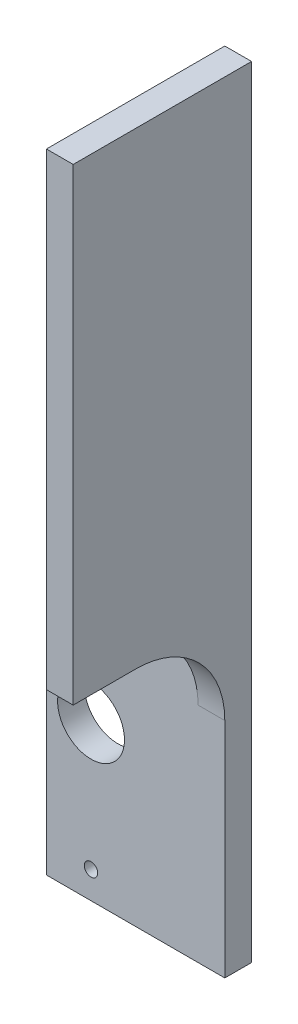
ISO-10303-21;
HEADER;
FILE_DESCRIPTION(('STEP AP214'),'2;1');
FILE_NAME('part.step','',(''),(''),'','','');
FILE_SCHEMA(('AUTOMOTIVE_DESIGN { 1 0 10303 214 1 1 1 1 }'));
ENDSEC;
DATA;
#1=APPLICATION_CONTEXT('core data for automotive mechanical design processes');
#2=APPLICATION_PROTOCOL_DEFINITION('international standard','automotive_design',2000,#1);
#3=PRODUCT_CONTEXT('',#1,'mechanical');
#4=PRODUCT('Part','Part','',(#3));
#5=PRODUCT_RELATED_PRODUCT_CATEGORY('part','',(#4));
#6=PRODUCT_DEFINITION_FORMATION('','',#4);
#7=PRODUCT_DEFINITION_CONTEXT('part definition',#1,'design');
#8=PRODUCT_DEFINITION('design','',#6,#7);
#9=PRODUCT_DEFINITION_SHAPE('','',#8);
#10=(LENGTH_UNIT() NAMED_UNIT(*) SI_UNIT(.MILLI.,.METRE.));
#11=(NAMED_UNIT(*) PLANE_ANGLE_UNIT() SI_UNIT($,.RADIAN.));
#12=(NAMED_UNIT(*) SI_UNIT($,.STERADIAN.) SOLID_ANGLE_UNIT());
#13=UNCERTAINTY_MEASURE_WITH_UNIT(LENGTH_MEASURE(1.E-05),#10,'distance_accuracy_value','');
#14=(GEOMETRIC_REPRESENTATION_CONTEXT(3) GLOBAL_UNCERTAINTY_ASSIGNED_CONTEXT((#13)) GLOBAL_UNIT_ASSIGNED_CONTEXT((#10,
#11,#12)) REPRESENTATION_CONTEXT('',''));
#15=CARTESIAN_POINT('',(0.,0.,0.));
#16=DIRECTION('',(0.,0.,1.));
#17=DIRECTION('',(1.,0.,0.));
#18=AXIS2_PLACEMENT_3D('',#15,#16,#17);
#19=CARTESIAN_POINT('',(10.6,25.,3.));
#20=CARTESIAN_POINT('',(10.4000000000003,25.,3.));
#21=CARTESIAN_POINT('',(10.1999999999997,25.,3.));
#22=CARTESIAN_POINT('',(9.0000000000016,25.,3.));
#23=CARTESIAN_POINT('',(8.00000000000025,24.9999999999983,3.));
#24=CARTESIAN_POINT('',(5.99999999999976,25.0000000000017,3.));
#25=CARTESIAN_POINT('',(5.0000000000002,24.9999999999983,3.));
#26=CARTESIAN_POINT('',(4.00000000000001,25.,3.));
#27=CARTESIAN_POINT('',(10.6,35.,3.));
#28=CARTESIAN_POINT('',(10.4000000000003,35.,3.));
#29=CARTESIAN_POINT('',(10.1999999999997,35.,3.));
#30=CARTESIAN_POINT('',(9.0000000000016,35.,3.));
#31=CARTESIAN_POINT('',(8.00000000000025,35.,3.));
#32=CARTESIAN_POINT('',(5.99999999999976,35.,3.));
#33=CARTESIAN_POINT('',(5.0000000000002,35.,3.));
#34=CARTESIAN_POINT('',(4.00000000000001,35.,3.));
#35=CARTESIAN_POINT('',(10.6,35.,13.));
#36=CARTESIAN_POINT('',(10.4000000000003,35.,13.));
#37=CARTESIAN_POINT('',(10.1999999999997,35.,13.));
#38=CARTESIAN_POINT('',(9.0000000000016,35.,13.));
#39=CARTESIAN_POINT('',(8.00000000000025,35.,13.0000000000017));
#40=CARTESIAN_POINT('',(5.99999999999976,35.,12.9999999999983));
#41=CARTESIAN_POINT('',(5.00000000000019,35.,13.0000000000017));
#42=CARTESIAN_POINT('',(4.00000000000001,35.,13.));
#43=(BOUNDED_SURFACE() B_SPLINE_SURFACE(2,3,((#19,#20,#21,#22,#23,#24,#25,#26),(#27,#28,#29,#30,
#31,#32,#33,#34),(#35,#36,#37,#38,#39,#40,#41,#42)),.UNSPECIFIED.,.F.,.F.,
.F.) B_SPLINE_SURFACE_WITH_KNOTS((3,3),(4,2,2,4),(0.,1.),(-0.200000000000003,0.,1.,2.),
.UNSPECIFIED.) GEOMETRIC_REPRESENTATION_ITEM() RATIONAL_B_SPLINE_SURFACE(((1.,1.,1.,1.,1.,1.,1.,
1.),(0.707106781186548,0.707106781186548,0.707106781186548,0.707106781186548,0.707106781186548,
0.707106781186548,0.707106781186548,0.707106781186548),(1.,1.,1.,1.,1.,1.,1.,1.))) REPRESENTATION_ITEM('') SURFACE());
#44=CARTESIAN_POINT('',(10.6,35.,13.));
#45=CARTESIAN_POINT('',(10.4000000000003,35.,13.));
#46=CARTESIAN_POINT('',(10.1999999999997,35.,13.));
#47=CARTESIAN_POINT('',(9.0000000000016,35.,13.));
#48=CARTESIAN_POINT('',(8.00000000000025,35.,13.0000000000017));
#49=CARTESIAN_POINT('',(5.99999999999976,35.,12.9999999999983));
#50=CARTESIAN_POINT('',(5.00000000000019,35.,13.0000000000017));
#51=CARTESIAN_POINT('',(4.00000000000001,35.,13.));
#52=(BOUNDED_CURVE() B_SPLINE_CURVE(3,(#44,#45,#46,#47,#48,#49,#50,#51),.UNSPECIFIED.,.F.,
.F.) B_SPLINE_CURVE_WITH_KNOTS((4,2,2,4),(-0.200000000000003,0.,1.,2.),
.UNSPECIFIED.) CURVE() GEOMETRIC_REPRESENTATION_ITEM() RATIONAL_B_SPLINE_CURVE((1.,1.,1.,1.,1.,
1.,1.,1.)) REPRESENTATION_ITEM(''));
#53=CARTESIAN_POINT('',(7.,35.,13.));
#54=VERTEX_POINT('',#53);
#55=CARTESIAN_POINT('',(10.,35.,13.));
#56=VERTEX_POINT('',#55);
#57=EDGE_CURVE('E248',#54,#56,#52,.F.);
#58=CARTESIAN_POINT('',(7.,35.,13.));
#59=CARTESIAN_POINT('',(7.,35.,3.));
#60=CARTESIAN_POINT('',(7.,25.,3.));
#61=(BOUNDED_CURVE() B_SPLINE_CURVE(2,(#58,#59,#60),.UNSPECIFIED.,.F.,
.F.) B_SPLINE_CURVE_WITH_KNOTS((3,3),(0.,1.),
.UNSPECIFIED.) CURVE() GEOMETRIC_REPRESENTATION_ITEM() RATIONAL_B_SPLINE_CURVE((1.,
0.707106781186548,1.)) REPRESENTATION_ITEM(''));
#62=CARTESIAN_POINT('',(7.,25.,3.));
#63=VERTEX_POINT('',#62);
#64=EDGE_CURVE('E61',#54,#63,#61,.T.);
#65=CARTESIAN_POINT('',(4.00000000000001,25.,3.));
#66=CARTESIAN_POINT('',(5.0000000000002,24.9999999999983,3.));
#67=CARTESIAN_POINT('',(5.99999999999976,25.0000000000017,3.));
#68=CARTESIAN_POINT('',(8.00000000000025,24.9999999999983,3.));
#69=CARTESIAN_POINT('',(9.0000000000016,25.,3.));
#70=CARTESIAN_POINT('',(10.1999999999997,25.,3.));
#71=CARTESIAN_POINT('',(10.4000000000003,25.,3.));
#72=CARTESIAN_POINT('',(10.6,25.,3.));
#73=(BOUNDED_CURVE() B_SPLINE_CURVE(3,(#65,#66,#67,#68,#69,#70,#71,#72),.UNSPECIFIED.,.F.,
.F.) B_SPLINE_CURVE_WITH_KNOTS((4,2,2,4),(-0.200000000000003,0.799999999999997,1.8,2.),
.UNSPECIFIED.) CURVE() GEOMETRIC_REPRESENTATION_ITEM() RATIONAL_B_SPLINE_CURVE((1.,1.,1.,1.,1.,
1.,1.,1.)) REPRESENTATION_ITEM(''));
#74=CARTESIAN_POINT('',(10.,25.,3.));
#75=VERTEX_POINT('',#74);
#76=EDGE_CURVE('E204',#75,#63,#73,.F.);
#77=CARTESIAN_POINT('',(10.,25.,3.));
#78=CARTESIAN_POINT('',(9.99999999999999,35.,3.));
#79=CARTESIAN_POINT('',(10.,35.,13.));
#80=(BOUNDED_CURVE() B_SPLINE_CURVE(2,(#77,#78,#79),.UNSPECIFIED.,.F.,
.F.) B_SPLINE_CURVE_WITH_KNOTS((3,3),(0.,1.),
.UNSPECIFIED.) CURVE() GEOMETRIC_REPRESENTATION_ITEM() RATIONAL_B_SPLINE_CURVE((1.,
0.707106781186548,1.)) REPRESENTATION_ITEM(''));
#81=EDGE_CURVE('E12',#75,#56,#80,.T.);
#82=ORIENTED_EDGE('',*,*,#57,.F.);
#83=ORIENTED_EDGE('',*,*,#64,.T.);
#84=ORIENTED_EDGE('',*,*,#76,.F.);
#85=ORIENTED_EDGE('',*,*,#81,.T.);
#86=EDGE_LOOP('',(#82,#83,#84,#85));
#87=FACE_BOUND('',#86,.T.);
#88=ADVANCED_FACE('F47',(#87),#43,.T.);
#89=CARTESIAN_POINT('',(0.,35.,3.));
#90=DIRECTION('',(0.,-1.,0.));
#91=DIRECTION('',(0.,0.,-1.));
#92=AXIS2_PLACEMENT_3D('',#89,#90,#91);
#93=PLANE('',#92);
#94=DIRECTION('',(0.,0.,1.));
#95=VECTOR('',#94,1.);
#96=CARTESIAN_POINT('',(7.,35.,0.));
#97=LINE('',#96,#95);
#98=CARTESIAN_POINT('',(7.,35.,0.));
#99=VERTEX_POINT('',#98);
#100=CARTESIAN_POINT('',(7.,35.,3.));
#101=VERTEX_POINT('',#100);
#102=EDGE_CURVE('E259',#99,#101,#97,.T.);
#103=ORIENTED_EDGE('',*,*,#102,.F.);
#104=DIRECTION('',(-1.,0.,0.));
#105=VECTOR('',#104,1.);
#106=CARTESIAN_POINT('',(0.,35.,0.));
#107=LINE('',#106,#105);
#108=CARTESIAN_POINT('',(-10.,35.,0.));
#109=VERTEX_POINT('',#108);
#110=EDGE_CURVE('E282',#99,#109,#107,.T.);
#111=ORIENTED_EDGE('',*,*,#110,.T.);
#112=DIRECTION('',(0.,0.,-1.));
#113=VECTOR('',#112,1.);
#114=CARTESIAN_POINT('',(-10.,35.,3.));
#115=LINE('',#114,#113);
#116=CARTESIAN_POINT('',(-10.,35.,3.));
#117=VERTEX_POINT('',#116);
#118=EDGE_CURVE('E299',#117,#109,#115,.T.);
#119=ORIENTED_EDGE('',*,*,#118,.F.);
#120=DIRECTION('',(-1.,0.,0.));
#121=VECTOR('',#120,1.);
#122=CARTESIAN_POINT('',(0.,35.,3.));
#123=LINE('',#122,#121);
#124=EDGE_CURVE('E191',#101,#117,#123,.T.);
#125=ORIENTED_EDGE('',*,*,#124,.F.);
#126=EDGE_LOOP('',(#103,#111,#119,#125));
#127=FACE_BOUND('',#126,.T.);
#128=ADVANCED_FACE('F223',(#127),#93,.F.);
#129=CARTESIAN_POINT('',(0.,0.,3.));
#130=DIRECTION('',(0.,0.,-1.));
#131=DIRECTION('',(-1.,0.,0.));
#132=AXIS2_PLACEMENT_3D('',#129,#130,#131);
#133=PLANE('',#132);
#134=DIRECTION('',(0.,1.,0.));
#135=VECTOR('',#134,1.);
#136=CARTESIAN_POINT('',(10.,35.,3.));
#137=LINE('',#136,#135);
#138=CARTESIAN_POINT('',(10.,0.,3.));
#139=VERTEX_POINT('',#138);
#140=EDGE_CURVE('E187',#139,#75,#137,.T.);
#141=ORIENTED_EDGE('',*,*,#140,.T.);
#142=ORIENTED_EDGE('',*,*,#76,.T.);
#143=DIRECTION('',(0.,1.,0.));
#144=VECTOR('',#143,1.);
#145=CARTESIAN_POINT('',(7.,87.5,3.));
#146=LINE('',#145,#144);
#147=EDGE_CURVE('E210',#63,#101,#146,.T.);
#148=ORIENTED_EDGE('',*,*,#147,.T.);
#149=ORIENTED_EDGE('',*,*,#124,.T.);
#150=DIRECTION('',(0.,-1.,0.));
#151=VECTOR('',#150,1.);
#152=CARTESIAN_POINT('',(-10.,0.,3.));
#153=LINE('',#152,#151);
#154=CARTESIAN_POINT('',(-10.,0.,3.));
#155=VERTEX_POINT('',#154);
#156=EDGE_CURVE('E300',#117,#155,#153,.T.);
#157=ORIENTED_EDGE('',*,*,#156,.T.);
#158=DIRECTION('',(1.,0.,0.));
#159=VECTOR('',#158,1.);
#160=CARTESIAN_POINT('',(0.,0.,3.));
#161=LINE('',#160,#159);
#162=EDGE_CURVE('E183',#155,#139,#161,.T.);
#163=ORIENTED_EDGE('',*,*,#162,.T.);
#164=EDGE_LOOP('',(#141,#142,#148,#149,#157,#163));
#165=FACE_BOUND('',#164,.T.);
#166=CARTESIAN_POINT('',(-5.,31.95,3.));
#167=DIRECTION('',(0.,0.,1.));
#168=DIRECTION('',(1.,0.,0.));
#169=AXIS2_PLACEMENT_3D('',#166,#167,#168);
#170=CIRCLE('',#169,0.750000000000001);
#171=CARTESIAN_POINT('',(-4.25,31.95,3.));
#172=VERTEX_POINT('',#171);
#173=EDGE_CURVE('E175',#172,#172,#170,.T.);
#174=ORIENTED_EDGE('',*,*,#173,.F.);
#175=EDGE_LOOP('',(#174));
#176=FACE_BOUND('',#175,.T.);
#177=CARTESIAN_POINT('',(-5.,3.05,3.));
#178=DIRECTION('',(0.,0.,1.));
#179=DIRECTION('',(-1.,0.,0.));
#180=AXIS2_PLACEMENT_3D('',#177,#178,#179);
#181=CIRCLE('',#180,0.750000000000001);
#182=CARTESIAN_POINT('',(-5.75,3.05,3.));
#183=VERTEX_POINT('',#182);
#184=EDGE_CURVE('E167',#183,#183,#181,.T.);
#185=ORIENTED_EDGE('',*,*,#184,.F.);
#186=EDGE_LOOP('',(#185));
#187=FACE_BOUND('',#186,.T.);
#188=CARTESIAN_POINT('',(-5.,17.5,3.));
#189=DIRECTION('',(0.,0.,1.));
#190=DIRECTION('',(1.,0.,0.));
#191=AXIS2_PLACEMENT_3D('',#188,#189,#190);
#192=CIRCLE('',#191,3.75);
#193=CARTESIAN_POINT('',(-1.25,17.5,3.));
#194=VERTEX_POINT('',#193);
#195=EDGE_CURVE('E157',#194,#194,#192,.T.);
#196=ORIENTED_EDGE('',*,*,#195,.F.);
#197=EDGE_LOOP('',(#196));
#198=FACE_BOUND('',#197,.T.);
#199=ADVANCED_FACE('F212',(#165,#176,#187,#198),#133,.F.);
#200=CARTESIAN_POINT('',(0.,0.,0.));
#201=DIRECTION('',(0.,0.,-1.));
#202=DIRECTION('',(-1.,0.,0.));
#203=AXIS2_PLACEMENT_3D('',#200,#201,#202);
#204=PLANE('',#203);
#205=CARTESIAN_POINT('',(-5.,3.05,0.));
#206=DIRECTION('',(0.,0.,1.));
#207=DIRECTION('',(-1.,0.,0.));
#208=AXIS2_PLACEMENT_3D('',#205,#206,#207);
#209=CIRCLE('',#208,0.750000000000001);
#210=CARTESIAN_POINT('',(-5.75,3.05,0.));
#211=VERTEX_POINT('',#210);
#212=EDGE_CURVE('E165',#211,#211,#209,.T.);
#213=ORIENTED_EDGE('',*,*,#212,.T.);
#214=EDGE_LOOP('',(#213));
#215=FACE_BOUND('',#214,.T.);
#216=DIRECTION('',(0.,1.,0.));
#217=VECTOR('',#216,1.);
#218=CARTESIAN_POINT('',(10.,35.,0.));
#219=LINE('',#218,#217);
#220=CARTESIAN_POINT('',(10.,0.,0.));
#221=VERTEX_POINT('',#220);
#222=CARTESIAN_POINT('',(10.,87.5,0.));
#223=VERTEX_POINT('',#222);
#224=EDGE_CURVE('E179',#221,#223,#219,.T.);
#225=ORIENTED_EDGE('',*,*,#224,.F.);
#226=DIRECTION('',(1.,0.,0.));
#227=VECTOR('',#226,1.);
#228=CARTESIAN_POINT('',(0.,0.,0.));
#229=LINE('',#228,#227);
#230=CARTESIAN_POINT('',(-10.,0.,0.));
#231=VERTEX_POINT('',#230);
#232=EDGE_CURVE('E188',#231,#221,#229,.T.);
#233=ORIENTED_EDGE('',*,*,#232,.F.);
#234=DIRECTION('',(0.,-1.,0.));
#235=VECTOR('',#234,1.);
#236=CARTESIAN_POINT('',(-10.,0.,0.));
#237=LINE('',#236,#235);
#238=EDGE_CURVE('E283',#109,#231,#237,.T.);
#239=ORIENTED_EDGE('',*,*,#238,.F.);
#240=ORIENTED_EDGE('',*,*,#110,.F.);
#241=DIRECTION('',(0.,-1.,0.));
#242=VECTOR('',#241,1.);
#243=CARTESIAN_POINT('',(7.,87.5,0.));
#244=LINE('',#243,#242);
#245=CARTESIAN_POINT('',(7.,87.5,0.));
#246=VERTEX_POINT('',#245);
#247=EDGE_CURVE('E159',#246,#99,#244,.T.);
#248=ORIENTED_EDGE('',*,*,#247,.F.);
#249=DIRECTION('',(-1.,0.,0.));
#250=VECTOR('',#249,1.);
#251=CARTESIAN_POINT('',(7.,87.5,0.));
#252=LINE('',#251,#250);
#253=EDGE_CURVE('E139',#223,#246,#252,.T.);
#254=ORIENTED_EDGE('',*,*,#253,.F.);
#255=EDGE_LOOP('',(#225,#233,#239,#240,#248,#254));
#256=FACE_BOUND('',#255,.T.);
#257=CARTESIAN_POINT('',(-5.,31.95,0.));
#258=DIRECTION('',(0.,0.,1.));
#259=DIRECTION('',(1.,0.,0.));
#260=AXIS2_PLACEMENT_3D('',#257,#258,#259);
#261=CIRCLE('',#260,0.750000000000001);
#262=CARTESIAN_POINT('',(-4.25,31.95,0.));
#263=VERTEX_POINT('',#262);
#264=EDGE_CURVE('E171',#263,#263,#261,.T.);
#265=ORIENTED_EDGE('',*,*,#264,.T.);
#266=EDGE_LOOP('',(#265));
#267=FACE_BOUND('',#266,.T.);
#268=CARTESIAN_POINT('',(-5.,17.5,0.));
#269=DIRECTION('',(0.,0.,1.));
#270=DIRECTION('',(1.,0.,0.));
#271=AXIS2_PLACEMENT_3D('',#268,#269,#270);
#272=CIRCLE('',#271,3.75);
#273=CARTESIAN_POINT('',(-1.25,17.5,0.));
#274=VERTEX_POINT('',#273);
#275=EDGE_CURVE('E152',#274,#274,#272,.T.);
#276=ORIENTED_EDGE('',*,*,#275,.T.);
#277=EDGE_LOOP('',(#276));
#278=FACE_BOUND('',#277,.T.);
#279=ADVANCED_FACE('F222',(#215,#256,#267,#278),#204,.T.);
#280=CARTESIAN_POINT('',(10.,35.,3.));
#281=DIRECTION('',(-1.,0.,0.));
#282=DIRECTION('',(0.,0.,1.));
#283=AXIS2_PLACEMENT_3D('',#280,#281,#282);
#284=PLANE('',#283);
#285=ORIENTED_EDGE('',*,*,#224,.T.);
#286=DIRECTION('',(0.,0.,-1.));
#287=VECTOR('',#286,1.);
#288=CARTESIAN_POINT('',(10.,87.5,0.));
#289=LINE('',#288,#287);
#290=CARTESIAN_POINT('',(10.,87.5,20.));
#291=VERTEX_POINT('',#290);
#292=EDGE_CURVE('E133',#291,#223,#289,.T.);
#293=ORIENTED_EDGE('',*,*,#292,.F.);
#294=DIRECTION('',(0.,-1.,0.));
#295=VECTOR('',#294,1.);
#296=CARTESIAN_POINT('',(10.,87.5,20.));
#297=LINE('',#296,#295);
#298=CARTESIAN_POINT('',(10.,35.,20.));
#299=VERTEX_POINT('',#298);
#300=EDGE_CURVE('E128',#291,#299,#297,.T.);
#301=ORIENTED_EDGE('',*,*,#300,.T.);
#302=DIRECTION('',(0.,0.,-1.));
#303=VECTOR('',#302,1.);
#304=CARTESIAN_POINT('',(10.,35.,0.));
#305=LINE('',#304,#303);
#306=EDGE_CURVE('E144',#299,#56,#305,.T.);
#307=ORIENTED_EDGE('',*,*,#306,.T.);
#308=ORIENTED_EDGE('',*,*,#81,.F.);
#309=ORIENTED_EDGE('',*,*,#140,.F.);
#310=DIRECTION('',(0.,0.,-1.));
#311=VECTOR('',#310,1.);
#312=CARTESIAN_POINT('',(10.,0.,3.));
#313=LINE('',#312,#311);
#314=EDGE_CURVE('E254',#139,#221,#313,.T.);
#315=ORIENTED_EDGE('',*,*,#314,.T.);
#316=EDGE_LOOP('',(#285,#293,#301,#307,#308,#309,#315));
#317=FACE_BOUND('',#316,.T.);
#318=ADVANCED_FACE('F228',(#317),#284,.F.);
#319=CARTESIAN_POINT('',(-10.,0.,3.));
#320=DIRECTION('',(1.,0.,0.));
#321=DIRECTION('',(0.,0.,-1.));
#322=AXIS2_PLACEMENT_3D('',#319,#320,#321);
#323=PLANE('',#322);
#324=ORIENTED_EDGE('',*,*,#238,.T.);
#325=DIRECTION('',(0.,0.,-1.));
#326=VECTOR('',#325,1.);
#327=CARTESIAN_POINT('',(-10.,0.,3.));
#328=LINE('',#327,#326);
#329=EDGE_CURVE('E295',#155,#231,#328,.T.);
#330=ORIENTED_EDGE('',*,*,#329,.F.);
#331=ORIENTED_EDGE('',*,*,#156,.F.);
#332=ORIENTED_EDGE('',*,*,#118,.T.);
#333=EDGE_LOOP('',(#324,#330,#331,#332));
#334=FACE_BOUND('',#333,.T.);
#335=ADVANCED_FACE('F233',(#334),#323,.F.);
#336=CARTESIAN_POINT('',(0.,0.,3.));
#337=DIRECTION('',(0.,1.,0.));
#338=DIRECTION('',(-1.,0.,0.));
#339=AXIS2_PLACEMENT_3D('',#336,#337,#338);
#340=PLANE('',#339);
#341=ORIENTED_EDGE('',*,*,#232,.T.);
#342=ORIENTED_EDGE('',*,*,#314,.F.);
#343=ORIENTED_EDGE('',*,*,#162,.F.);
#344=ORIENTED_EDGE('',*,*,#329,.T.);
#345=EDGE_LOOP('',(#341,#342,#343,#344));
#346=FACE_BOUND('',#345,.T.);
#347=ADVANCED_FACE('F230',(#346),#340,.F.);
#348=CARTESIAN_POINT('',(-5.,31.95,3.));
#349=DIRECTION('',(0.,0.,-1.));
#350=DIRECTION('',(-1.,0.,0.));
#351=AXIS2_PLACEMENT_3D('',#348,#349,#350);
#352=CYLINDRICAL_SURFACE('',#351,0.750000000000001);
#353=ORIENTED_EDGE('',*,*,#173,.T.);
#354=EDGE_LOOP('',(#353));
#355=FACE_BOUND('',#354,.T.);
#356=ORIENTED_EDGE('',*,*,#264,.F.);
#357=EDGE_LOOP('',(#356));
#358=FACE_BOUND('',#357,.T.);
#359=ADVANCED_FACE('F224',(#355,#358),#352,.F.);
#360=CARTESIAN_POINT('',(-5.,3.05,3.));
#361=DIRECTION('',(0.,0.,-1.));
#362=DIRECTION('',(-1.,0.,0.));
#363=AXIS2_PLACEMENT_3D('',#360,#361,#362);
#364=CYLINDRICAL_SURFACE('',#363,0.750000000000001);
#365=ORIENTED_EDGE('',*,*,#184,.T.);
#366=EDGE_LOOP('',(#365));
#367=FACE_BOUND('',#366,.T.);
#368=ORIENTED_EDGE('',*,*,#212,.F.);
#369=EDGE_LOOP('',(#368));
#370=FACE_BOUND('',#369,.T.);
#371=ADVANCED_FACE('F323',(#367,#370),#364,.F.);
#372=CARTESIAN_POINT('',(-5.,17.5,3.));
#373=DIRECTION('',(0.,0.,-1.));
#374=DIRECTION('',(-1.,0.,0.));
#375=AXIS2_PLACEMENT_3D('',#372,#373,#374);
#376=CYLINDRICAL_SURFACE('',#375,3.75);
#377=ORIENTED_EDGE('',*,*,#195,.T.);
#378=EDGE_LOOP('',(#377));
#379=FACE_BOUND('',#378,.T.);
#380=ORIENTED_EDGE('',*,*,#275,.F.);
#381=EDGE_LOOP('',(#380));
#382=FACE_BOUND('',#381,.T.);
#383=ADVANCED_FACE('F320',(#379,#382),#376,.F.);
#384=CARTESIAN_POINT('',(7.,87.5,0.));
#385=DIRECTION('',(1.,0.,0.));
#386=DIRECTION('',(0.,0.,-1.));
#387=AXIS2_PLACEMENT_3D('',#384,#385,#386);
#388=PLANE('',#387);
#389=ORIENTED_EDGE('',*,*,#102,.T.);
#390=ORIENTED_EDGE('',*,*,#147,.F.);
#391=ORIENTED_EDGE('',*,*,#64,.F.);
#392=CARTESIAN_POINT('',(7.,35.,20.));
#393=VERTEX_POINT('',#392);
#394=EDGE_CURVE('E149',#54,#393,#97,.T.);
#395=ORIENTED_EDGE('',*,*,#394,.T.);
#396=DIRECTION('',(0.,-1.,0.));
#397=VECTOR('',#396,1.);
#398=CARTESIAN_POINT('',(7.,87.5,20.));
#399=LINE('',#398,#397);
#400=CARTESIAN_POINT('',(7.,87.5,20.));
#401=VERTEX_POINT('',#400);
#402=EDGE_CURVE('E126',#401,#393,#399,.T.);
#403=ORIENTED_EDGE('',*,*,#402,.F.);
#404=DIRECTION('',(0.,0.,1.));
#405=VECTOR('',#404,1.);
#406=CARTESIAN_POINT('',(7.,87.5,0.));
#407=LINE('',#406,#405);
#408=EDGE_CURVE('E134',#246,#401,#407,.T.);
#409=ORIENTED_EDGE('',*,*,#408,.F.);
#410=ORIENTED_EDGE('',*,*,#247,.T.);
#411=EDGE_LOOP('',(#389,#390,#391,#395,#403,#409,#410));
#412=FACE_BOUND('',#411,.T.);
#413=ADVANCED_FACE('F147',(#412),#388,.F.);
#414=CARTESIAN_POINT('',(7.,87.5,20.));
#415=DIRECTION('',(0.,0.,-1.));
#416=DIRECTION('',(-1.,0.,0.));
#417=AXIS2_PLACEMENT_3D('',#414,#415,#416);
#418=PLANE('',#417);
#419=DIRECTION('',(1.,0.,0.));
#420=VECTOR('',#419,1.);
#421=CARTESIAN_POINT('',(7.,35.,20.));
#422=LINE('',#421,#420);
#423=EDGE_CURVE('E257',#393,#299,#422,.T.);
#424=ORIENTED_EDGE('',*,*,#423,.T.);
#425=ORIENTED_EDGE('',*,*,#300,.F.);
#426=DIRECTION('',(1.,0.,0.));
#427=VECTOR('',#426,1.);
#428=CARTESIAN_POINT('',(7.,87.5,20.));
#429=LINE('',#428,#427);
#430=EDGE_CURVE('E122',#401,#291,#429,.T.);
#431=ORIENTED_EDGE('',*,*,#430,.F.);
#432=ORIENTED_EDGE('',*,*,#402,.T.);
#433=EDGE_LOOP('',(#424,#425,#431,#432));
#434=FACE_BOUND('',#433,.T.);
#435=ADVANCED_FACE('F124',(#434),#418,.F.);
#436=CARTESIAN_POINT('',(0.,87.5,0.));
#437=DIRECTION('',(0.,1.,0.));
#438=DIRECTION('',(0.,0.,1.));
#439=AXIS2_PLACEMENT_3D('',#436,#437,#438);
#440=PLANE('',#439);
#441=ORIENTED_EDGE('',*,*,#408,.T.);
#442=ORIENTED_EDGE('',*,*,#430,.T.);
#443=ORIENTED_EDGE('',*,*,#292,.T.);
#444=ORIENTED_EDGE('',*,*,#253,.T.);
#445=EDGE_LOOP('',(#441,#442,#443,#444));
#446=FACE_BOUND('',#445,.T.);
#447=ADVANCED_FACE('F137',(#446),#440,.T.);
#448=CARTESIAN_POINT('',(0.,35.,0.));
#449=DIRECTION('',(0.,1.,0.));
#450=DIRECTION('',(0.,0.,1.));
#451=AXIS2_PLACEMENT_3D('',#448,#449,#450);
#452=PLANE('',#451);
#453=ORIENTED_EDGE('',*,*,#394,.F.);
#454=ORIENTED_EDGE('',*,*,#57,.T.);
#455=ORIENTED_EDGE('',*,*,#306,.F.);
#456=ORIENTED_EDGE('',*,*,#423,.F.);
#457=EDGE_LOOP('',(#453,#454,#455,#456));
#458=FACE_BOUND('',#457,.T.);
#459=ADVANCED_FACE('F256',(#458),#452,.F.);
#460=CLOSED_SHELL('',(#88,#128,#199,#279,#318,#335,#347,#359,#371,#383,#413,#435,#447,#459));
#461=MANIFOLD_SOLID_BREP('B2',#460);
#462=ADVANCED_BREP_SHAPE_REPRESENTATION('',(#18,#461),#14);
#463=SHAPE_DEFINITION_REPRESENTATION(#9,#462);
ENDSEC;
END-ISO-10303-21;
